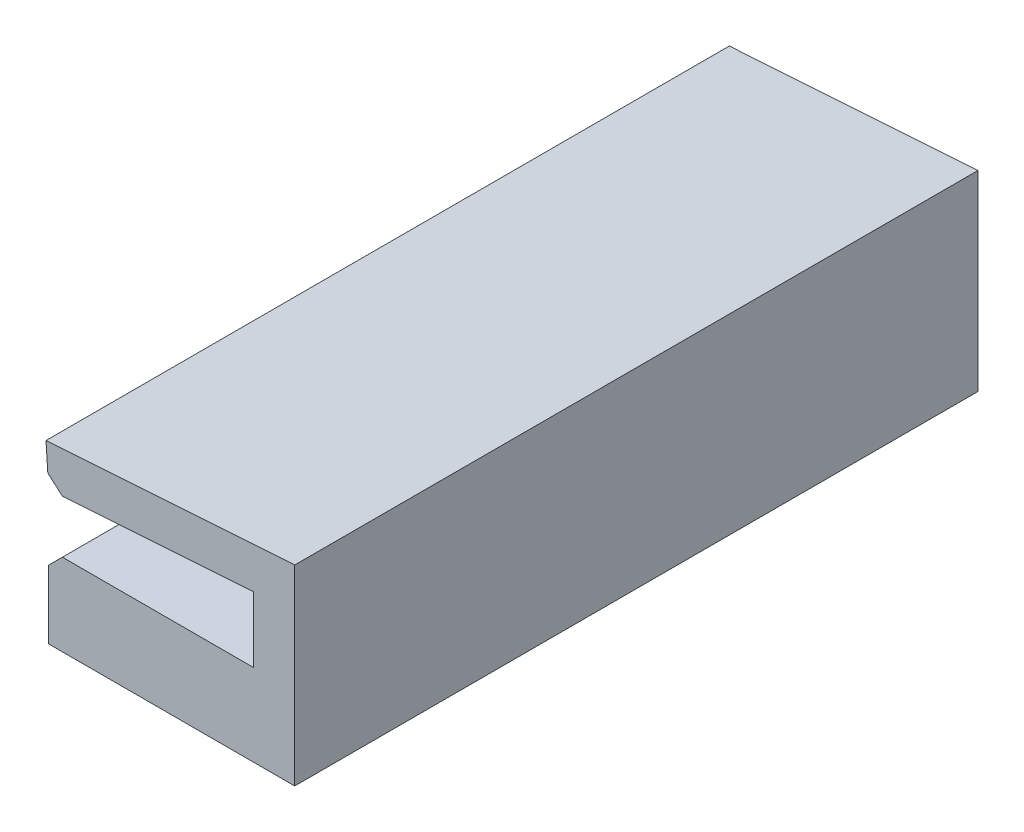
ISO-10303-21;
HEADER;
FILE_DESCRIPTION(('STEP AP214'),'2;1');
FILE_NAME('part.step','',(''),(''),'','','');
FILE_SCHEMA(('AUTOMOTIVE_DESIGN { 1 0 10303 214 1 1 1 1 }'));
ENDSEC;
DATA;
#1=APPLICATION_CONTEXT('core data for automotive mechanical design processes');
#2=APPLICATION_PROTOCOL_DEFINITION('international standard','automotive_design',2000,#1);
#3=PRODUCT_CONTEXT('',#1,'mechanical');
#4=PRODUCT('Part','Part','',(#3));
#5=PRODUCT_RELATED_PRODUCT_CATEGORY('part','',(#4));
#6=PRODUCT_DEFINITION_FORMATION('','',#4);
#7=PRODUCT_DEFINITION_CONTEXT('part definition',#1,'design');
#8=PRODUCT_DEFINITION('design','',#6,#7);
#9=PRODUCT_DEFINITION_SHAPE('','',#8);
#10=(LENGTH_UNIT() NAMED_UNIT(*) SI_UNIT(.MILLI.,.METRE.));
#11=(NAMED_UNIT(*) PLANE_ANGLE_UNIT() SI_UNIT($,.RADIAN.));
#12=(NAMED_UNIT(*) SI_UNIT($,.STERADIAN.) SOLID_ANGLE_UNIT());
#13=UNCERTAINTY_MEASURE_WITH_UNIT(LENGTH_MEASURE(1.E-05),#10,'distance_accuracy_value','');
#14=(GEOMETRIC_REPRESENTATION_CONTEXT(3) GLOBAL_UNCERTAINTY_ASSIGNED_CONTEXT((#13)) GLOBAL_UNIT_ASSIGNED_CONTEXT((#10,
#11,#12)) REPRESENTATION_CONTEXT('',''));
#15=CARTESIAN_POINT('',(0.,0.,0.));
#16=DIRECTION('',(0.,0.,1.));
#17=DIRECTION('',(1.,0.,0.));
#18=AXIS2_PLACEMENT_3D('',#15,#16,#17);
#19=CARTESIAN_POINT('',(0.,0.,50.));
#20=DIRECTION('',(0.,-1.,0.));
#21=DIRECTION('',(1.,0.,0.));
#22=AXIS2_PLACEMENT_3D('',#19,#20,#21);
#23=PLANE('',#22);
#24=DIRECTION('',(-1.,0.,0.));
#25=VECTOR('',#24,1.);
#26=CARTESIAN_POINT('',(0.,0.,0.));
#27=LINE('',#26,#25);
#28=CARTESIAN_POINT('',(0.,0.,0.));
#29=VERTEX_POINT('',#28);
#30=CARTESIAN_POINT('',(-14.,0.,0.));
#31=VERTEX_POINT('',#30);
#32=EDGE_CURVE('E150',#29,#31,#27,.T.);
#33=ORIENTED_EDGE('',*,*,#32,.T.);
#34=DIRECTION('',(0.,0.,1.));
#35=VECTOR('',#34,1.);
#36=CARTESIAN_POINT('',(-14.,0.,50.));
#37=LINE('',#36,#35);
#38=CARTESIAN_POINT('',(-14.,0.,50.));
#39=VERTEX_POINT('',#38);
#40=EDGE_CURVE('E220',#31,#39,#37,.T.);
#41=ORIENTED_EDGE('',*,*,#40,.T.);
#42=DIRECTION('',(-1.,0.,0.));
#43=VECTOR('',#42,1.);
#44=CARTESIAN_POINT('',(0.,0.,50.));
#45=LINE('',#44,#43);
#46=CARTESIAN_POINT('',(0.,0.,50.));
#47=VERTEX_POINT('',#46);
#48=EDGE_CURVE('E175',#47,#39,#45,.T.);
#49=ORIENTED_EDGE('',*,*,#48,.F.);
#50=DIRECTION('',(0.,0.,-1.));
#51=VECTOR('',#50,1.);
#52=CARTESIAN_POINT('',(0.,0.,50.));
#53=LINE('',#52,#51);
#54=EDGE_CURVE('E192',#47,#29,#53,.T.);
#55=ORIENTED_EDGE('',*,*,#54,.T.);
#56=EDGE_LOOP('',(#33,#41,#49,#55));
#57=FACE_BOUND('',#56,.T.);
#58=ADVANCED_FACE('F37',(#57),#23,.F.);
#59=CARTESIAN_POINT('',(-15.,0.,50.));
#60=DIRECTION('',(1.,0.,0.));
#61=DIRECTION('',(0.,0.,-1.));
#62=AXIS2_PLACEMENT_3D('',#59,#60,#61);
#63=PLANE('',#62);
#64=DIRECTION('',(0.,-1.,0.));
#65=VECTOR('',#64,1.);
#66=CARTESIAN_POINT('',(-15.,0.,50.));
#67=LINE('',#66,#65);
#68=CARTESIAN_POINT('',(-15.,-0.999999999999995,50.));
#69=VERTEX_POINT('',#68);
#70=CARTESIAN_POINT('',(-15.,-6.,50.));
#71=VERTEX_POINT('',#70);
#72=EDGE_CURVE('E178',#69,#71,#67,.T.);
#73=ORIENTED_EDGE('',*,*,#72,.F.);
#74=DIRECTION('',(0.,0.,-1.));
#75=VECTOR('',#74,1.);
#76=CARTESIAN_POINT('',(-15.,-0.999999999999995,50.));
#77=LINE('',#76,#75);
#78=CARTESIAN_POINT('',(-15.,-0.999999999999995,0.));
#79=VERTEX_POINT('',#78);
#80=EDGE_CURVE('E147',#69,#79,#77,.T.);
#81=ORIENTED_EDGE('',*,*,#80,.T.);
#82=DIRECTION('',(0.,-1.,0.));
#83=VECTOR('',#82,1.);
#84=CARTESIAN_POINT('',(-15.,0.,0.));
#85=LINE('',#84,#83);
#86=CARTESIAN_POINT('',(-15.,-6.,0.));
#87=VERTEX_POINT('',#86);
#88=EDGE_CURVE('E140',#79,#87,#85,.T.);
#89=ORIENTED_EDGE('',*,*,#88,.T.);
#90=DIRECTION('',(0.,0.,-1.));
#91=VECTOR('',#90,1.);
#92=CARTESIAN_POINT('',(-15.,-6.,50.));
#93=LINE('',#92,#91);
#94=EDGE_CURVE('E145',#71,#87,#93,.T.);
#95=ORIENTED_EDGE('',*,*,#94,.F.);
#96=EDGE_LOOP('',(#73,#81,#89,#95));
#97=FACE_BOUND('',#96,.T.);
#98=ADVANCED_FACE('F143',(#97),#63,.F.);
#99=CARTESIAN_POINT('',(3.,8.00665927567458,50.));
#100=DIRECTION('',(-1.,0.,0.));
#101=DIRECTION('',(0.,0.,1.));
#102=AXIS2_PLACEMENT_3D('',#99,#100,#101);
#103=PLANE('',#102);
#104=DIRECTION('',(0.,1.,0.));
#105=VECTOR('',#104,1.);
#106=CARTESIAN_POINT('',(3.,8.00665927567458,0.));
#107=LINE('',#106,#105);
#108=CARTESIAN_POINT('',(3.,-6.,0.));
#109=VERTEX_POINT('',#108);
#110=CARTESIAN_POINT('',(3.,8.00665927567458,0.));
#111=VERTEX_POINT('',#110);
#112=EDGE_CURVE('E149',#109,#111,#107,.T.);
#113=ORIENTED_EDGE('',*,*,#112,.T.);
#114=DIRECTION('',(0.,0.,-1.));
#115=VECTOR('',#114,1.);
#116=CARTESIAN_POINT('',(3.,8.00665927567458,50.));
#117=LINE('',#116,#115);
#118=CARTESIAN_POINT('',(3.,8.00665927567458,50.));
#119=VERTEX_POINT('',#118);
#120=EDGE_CURVE('E212',#119,#111,#117,.T.);
#121=ORIENTED_EDGE('',*,*,#120,.F.);
#122=DIRECTION('',(0.,1.,0.));
#123=VECTOR('',#122,1.);
#124=CARTESIAN_POINT('',(3.,8.00665927567458,50.));
#125=LINE('',#124,#123);
#126=CARTESIAN_POINT('',(3.,-6.,50.));
#127=VERTEX_POINT('',#126);
#128=EDGE_CURVE('E181',#127,#119,#125,.T.);
#129=ORIENTED_EDGE('',*,*,#128,.F.);
#130=DIRECTION('',(0.,0.,1.));
#131=VECTOR('',#130,1.);
#132=CARTESIAN_POINT('',(3.,-6.,50.));
#133=LINE('',#132,#131);
#134=EDGE_CURVE('E159',#109,#127,#133,.T.);
#135=ORIENTED_EDGE('',*,*,#134,.F.);
#136=EDGE_LOOP('',(#113,#121,#129,#135));
#137=FACE_BOUND('',#136,.T.);
#138=ADVANCED_FACE('F271',(#137),#103,.F.);
#139=CARTESIAN_POINT('',(3.,8.00665927567458,50.));
#140=DIRECTION('',(0.0665190105237739,-0.997785157856609,0.));
#141=DIRECTION('',(0.997785157856609,0.0665190105237739,0.));
#142=AXIS2_PLACEMENT_3D('',#139,#140,#141);
#143=PLANE('',#142);
#144=DIRECTION('',(-0.997785157856609,-0.0665190105237739,0.));
#145=VECTOR('',#144,1.);
#146=CARTESIAN_POINT('',(3.,8.00665927567458,0.));
#147=LINE('',#146,#145);
#148=CARTESIAN_POINT('',(-15.1995570315713,6.79335547356983,0.));
#149=VERTEX_POINT('',#148);
#150=EDGE_CURVE('E196',#111,#149,#147,.T.);
#151=ORIENTED_EDGE('',*,*,#150,.T.);
#152=DIRECTION('',(0.,0.,-1.));
#153=VECTOR('',#152,1.);
#154=CARTESIAN_POINT('',(-15.1995570315713,6.79335547356983,50.));
#155=LINE('',#154,#153);
#156=CARTESIAN_POINT('',(-15.1995570315713,6.79335547356983,50.));
#157=VERTEX_POINT('',#156);
#158=EDGE_CURVE('E209',#157,#149,#155,.T.);
#159=ORIENTED_EDGE('',*,*,#158,.F.);
#160=DIRECTION('',(-0.997785157856609,-0.0665190105237739,0.));
#161=VECTOR('',#160,1.);
#162=CARTESIAN_POINT('',(3.,8.00665927567458,50.));
#163=LINE('',#162,#161);
#164=EDGE_CURVE('E183',#119,#157,#163,.T.);
#165=ORIENTED_EDGE('',*,*,#164,.F.);
#166=ORIENTED_EDGE('',*,*,#120,.T.);
#167=EDGE_LOOP('',(#151,#159,#165,#166));
#168=FACE_BOUND('',#167,.T.);
#169=ADVANCED_FACE('F315',(#168),#143,.F.);
#170=CARTESIAN_POINT('',(-15.,3.8,50.));
#171=DIRECTION('',(0.997785157856609,0.0665190105237733,0.));
#172=DIRECTION('',(-0.0665190105237733,0.997785157856609,0.));
#173=AXIS2_PLACEMENT_3D('',#170,#171,#172);
#174=PLANE('',#173);
#175=DIRECTION('',(0.0665190105237733,-0.997785157856609,0.));
#176=VECTOR('',#175,1.);
#177=CARTESIAN_POINT('',(-15.,3.8,0.));
#178=LINE('',#177,#176);
#179=CARTESIAN_POINT('',(-15.0665190105238,4.79778515785663,0.));
#180=VERTEX_POINT('',#179);
#181=EDGE_CURVE('E198',#149,#180,#178,.T.);
#182=ORIENTED_EDGE('',*,*,#181,.T.);
#183=DIRECTION('',(0.,0.,1.));
#184=VECTOR('',#183,1.);
#185=CARTESIAN_POINT('',(-15.0665190105238,4.79778515785663,50.));
#186=LINE('',#185,#184);
#187=CARTESIAN_POINT('',(-15.0665190105238,4.79778515785663,50.));
#188=VERTEX_POINT('',#187);
#189=EDGE_CURVE('E229',#180,#188,#186,.T.);
#190=ORIENTED_EDGE('',*,*,#189,.T.);
#191=DIRECTION('',(0.0665190105237733,-0.997785157856609,0.));
#192=VECTOR('',#191,1.);
#193=CARTESIAN_POINT('',(-15.,3.8,50.));
#194=LINE('',#193,#192);
#195=EDGE_CURVE('E185',#157,#188,#194,.T.);
#196=ORIENTED_EDGE('',*,*,#195,.F.);
#197=ORIENTED_EDGE('',*,*,#158,.T.);
#198=EDGE_LOOP('',(#182,#190,#196,#197));
#199=FACE_BOUND('',#198,.T.);
#200=ADVANCED_FACE('F311',(#199),#174,.F.);
#201=CARTESIAN_POINT('',(0.,4.8,50.));
#202=DIRECTION('',(-0.066519010523774,0.997785157856609,0.));
#203=DIRECTION('',(-0.997785157856609,-0.066519010523774,0.));
#204=AXIS2_PLACEMENT_3D('',#201,#202,#203);
#205=PLANE('',#204);
#206=DIRECTION('',(0.997785157856609,0.066519010523774,0.));
#207=VECTOR('',#206,1.);
#208=CARTESIAN_POINT('',(0.,4.8,50.));
#209=LINE('',#208,#207);
#210=CARTESIAN_POINT('',(-14.0022148421434,3.86651901052377,50.));
#211=VERTEX_POINT('',#210);
#212=CARTESIAN_POINT('',(0.,4.8,50.));
#213=VERTEX_POINT('',#212);
#214=EDGE_CURVE('E188',#211,#213,#209,.T.);
#215=ORIENTED_EDGE('',*,*,#214,.F.);
#216=DIRECTION('',(0.,0.,-1.));
#217=VECTOR('',#216,1.);
#218=CARTESIAN_POINT('',(-14.0022148421434,3.86651901052377,50.));
#219=LINE('',#218,#217);
#220=CARTESIAN_POINT('',(-14.0022148421434,3.86651901052377,0.));
#221=VERTEX_POINT('',#220);
#222=EDGE_CURVE('E226',#211,#221,#219,.T.);
#223=ORIENTED_EDGE('',*,*,#222,.T.);
#224=DIRECTION('',(0.997785157856609,0.066519010523774,0.));
#225=VECTOR('',#224,1.);
#226=CARTESIAN_POINT('',(0.,4.8,0.));
#227=LINE('',#226,#225);
#228=CARTESIAN_POINT('',(0.,4.8,0.));
#229=VERTEX_POINT('',#228);
#230=EDGE_CURVE('E201',#221,#229,#227,.T.);
#231=ORIENTED_EDGE('',*,*,#230,.T.);
#232=DIRECTION('',(0.,0.,-1.));
#233=VECTOR('',#232,1.);
#234=CARTESIAN_POINT('',(0.,4.8,50.));
#235=LINE('',#234,#233);
#236=EDGE_CURVE('E206',#213,#229,#235,.T.);
#237=ORIENTED_EDGE('',*,*,#236,.F.);
#238=EDGE_LOOP('',(#215,#223,#231,#237));
#239=FACE_BOUND('',#238,.T.);
#240=ADVANCED_FACE('F298',(#239),#205,.F.);
#241=CARTESIAN_POINT('',(0.,4.8,50.));
#242=DIRECTION('',(1.,0.,0.));
#243=DIRECTION('',(0.,1.,0.));
#244=AXIS2_PLACEMENT_3D('',#241,#242,#243);
#245=PLANE('',#244);
#246=DIRECTION('',(0.,-1.,0.));
#247=VECTOR('',#246,1.);
#248=CARTESIAN_POINT('',(0.,4.8,0.));
#249=LINE('',#248,#247);
#250=EDGE_CURVE('E179',#229,#29,#249,.T.);
#251=ORIENTED_EDGE('',*,*,#250,.T.);
#252=ORIENTED_EDGE('',*,*,#54,.F.);
#253=DIRECTION('',(0.,-1.,0.));
#254=VECTOR('',#253,1.);
#255=CARTESIAN_POINT('',(0.,4.8,50.));
#256=LINE('',#255,#254);
#257=EDGE_CURVE('E190',#213,#47,#256,.T.);
#258=ORIENTED_EDGE('',*,*,#257,.F.);
#259=ORIENTED_EDGE('',*,*,#236,.T.);
#260=EDGE_LOOP('',(#251,#252,#258,#259));
#261=FACE_BOUND('',#260,.T.);
#262=ADVANCED_FACE('F304',(#261),#245,.F.);
#263=CARTESIAN_POINT('',(0.,0.,50.));
#264=DIRECTION('',(0.,0.,1.));
#265=DIRECTION('',(1.,0.,0.));
#266=AXIS2_PLACEMENT_3D('',#263,#264,#265);
#267=PLANE('',#266);
#268=ORIENTED_EDGE('',*,*,#48,.T.);
#269=DIRECTION('',(0.70710678118655,0.707106781186545,0.));
#270=VECTOR('',#269,1.);
#271=CARTESIAN_POINT('',(-6.99999999999995,7.,50.));
#272=LINE('',#271,#270);
#273=EDGE_CURVE('E224',#39,#69,#272,.F.);
#274=ORIENTED_EDGE('',*,*,#273,.T.);
#275=ORIENTED_EDGE('',*,*,#72,.T.);
#276=DIRECTION('',(-1.,0.,0.));
#277=VECTOR('',#276,1.);
#278=CARTESIAN_POINT('',(-15.,-6.,50.));
#279=LINE('',#278,#277);
#280=EDGE_CURVE('E164',#127,#71,#279,.T.);
#281=ORIENTED_EDGE('',*,*,#280,.F.);
#282=ORIENTED_EDGE('',*,*,#128,.T.);
#283=ORIENTED_EDGE('',*,*,#164,.T.);
#284=ORIENTED_EDGE('',*,*,#195,.T.);
#285=DIRECTION('',(-0.752576694706875,0.658504607868522,0.));
#286=VECTOR('',#285,1.);
#287=CARTESIAN_POINT('',(-4.15560586438674,-4.74926384501337,50.));
#288=LINE('',#287,#286);
#289=EDGE_CURVE('E222',#188,#211,#288,.F.);
#290=ORIENTED_EDGE('',*,*,#289,.T.);
#291=ORIENTED_EDGE('',*,*,#214,.T.);
#292=ORIENTED_EDGE('',*,*,#257,.T.);
#293=EDGE_LOOP('',(#268,#274,#275,#281,#282,#283,#284,#290,#291,#292));
#294=FACE_BOUND('',#293,.T.);
#295=ADVANCED_FACE('F294',(#294),#267,.T.);
#296=CARTESIAN_POINT('',(0.,0.,0.));
#297=DIRECTION('',(0.,0.,1.));
#298=DIRECTION('',(1.,0.,0.));
#299=AXIS2_PLACEMENT_3D('',#296,#297,#298);
#300=PLANE('',#299);
#301=ORIENTED_EDGE('',*,*,#88,.F.);
#302=DIRECTION('',(-0.70710678118655,-0.707106781186545,0.));
#303=VECTOR('',#302,1.);
#304=CARTESIAN_POINT('',(-15.,-0.999999999999995,0.));
#305=LINE('',#304,#303);
#306=EDGE_CURVE('E218',#79,#31,#305,.F.);
#307=ORIENTED_EDGE('',*,*,#306,.T.);
#308=ORIENTED_EDGE('',*,*,#32,.F.);
#309=ORIENTED_EDGE('',*,*,#250,.F.);
#310=ORIENTED_EDGE('',*,*,#230,.F.);
#311=DIRECTION('',(0.752576694706875,-0.658504607868522,0.));
#312=VECTOR('',#311,1.);
#313=CARTESIAN_POINT('',(-14.0022148421434,3.86651901052377,0.));
#314=LINE('',#313,#312);
#315=EDGE_CURVE('E216',#221,#180,#314,.F.);
#316=ORIENTED_EDGE('',*,*,#315,.T.);
#317=ORIENTED_EDGE('',*,*,#181,.F.);
#318=ORIENTED_EDGE('',*,*,#150,.F.);
#319=ORIENTED_EDGE('',*,*,#112,.F.);
#320=DIRECTION('',(1.,0.,0.));
#321=VECTOR('',#320,1.);
#322=CARTESIAN_POINT('',(-15.,-6.,0.));
#323=LINE('',#322,#321);
#324=EDGE_CURVE('E153',#87,#109,#323,.T.);
#325=ORIENTED_EDGE('',*,*,#324,.F.);
#326=EDGE_LOOP('',(#301,#307,#308,#309,#310,#316,#317,#318,#319,#325));
#327=FACE_BOUND('',#326,.T.);
#328=ADVANCED_FACE('F154',(#327),#300,.F.);
#329=CARTESIAN_POINT('',(0.,-6.,0.));
#330=DIRECTION('',(0.,-1.,0.));
#331=DIRECTION('',(0.,0.,-1.));
#332=AXIS2_PLACEMENT_3D('',#329,#330,#331);
#333=PLANE('',#332);
#334=ORIENTED_EDGE('',*,*,#94,.T.);
#335=ORIENTED_EDGE('',*,*,#324,.T.);
#336=ORIENTED_EDGE('',*,*,#134,.T.);
#337=ORIENTED_EDGE('',*,*,#280,.T.);
#338=EDGE_LOOP('',(#334,#335,#336,#337));
#339=FACE_BOUND('',#338,.T.);
#340=CARTESIAN_POINT('',(-6.,-6.,20.9));
#341=DIRECTION('',(0.,-1.,0.));
#342=DIRECTION('',(0.,0.,1.));
#343=AXIS2_PLACEMENT_3D('',#340,#341,#342);
#344=CIRCLE('',#343,4.);
#345=CARTESIAN_POINT('',(-7.64864328808813,-6.,24.5444444444444));
#346=VERTEX_POINT('',#345);
#347=CARTESIAN_POINT('',(-4.35135671191188,-6.,24.5444444444444));
#348=VERTEX_POINT('',#347);
#349=EDGE_CURVE('E165',#346,#348,#344,.T.);
#350=ORIENTED_EDGE('',*,*,#349,.F.);
#351=CARTESIAN_POINT('',(-7.85472369909915,-6.,25.));
#352=DIRECTION('',(0.,-1.,0.));
#353=DIRECTION('',(0.,0.,-1.));
#354=AXIS2_PLACEMENT_3D('',#351,#352,#353);
#355=CIRCLE('',#354,0.5);
#356=CARTESIAN_POINT('',(-7.64864328808813,-6.,25.4555555555556));
#357=VERTEX_POINT('',#356);
#358=EDGE_CURVE('E241',#346,#357,#355,.T.);
#359=ORIENTED_EDGE('',*,*,#358,.T.);
#360=CARTESIAN_POINT('',(-6.,-6.,29.1));
#361=DIRECTION('',(0.,-1.,0.));
#362=DIRECTION('',(0.,0.,-1.));
#363=AXIS2_PLACEMENT_3D('',#360,#361,#362);
#364=CIRCLE('',#363,4.);
#365=CARTESIAN_POINT('',(-4.35135671191188,-6.,25.4555555555556));
#366=VERTEX_POINT('',#365);
#367=EDGE_CURVE('E167',#366,#357,#364,.T.);
#368=ORIENTED_EDGE('',*,*,#367,.F.);
#369=CARTESIAN_POINT('',(-4.14527630090086,-6.,25.));
#370=DIRECTION('',(0.,-1.,0.));
#371=DIRECTION('',(0.,0.,-1.));
#372=AXIS2_PLACEMENT_3D('',#369,#370,#371);
#373=CIRCLE('',#372,0.5);
#374=EDGE_CURVE('E52',#366,#348,#373,.T.);
#375=ORIENTED_EDGE('',*,*,#374,.T.);
#376=EDGE_LOOP('',(#350,#359,#368,#375));
#377=FACE_BOUND('',#376,.T.);
#378=ADVANCED_FACE('F162',(#339,#377),#333,.T.);
#379=CARTESIAN_POINT('',(-6.,-6.,29.1));
#380=DIRECTION('',(0.,1.,0.));
#381=DIRECTION('',(0.,0.,1.));
#382=AXIS2_PLACEMENT_3D('',#379,#380,#381);
#383=CYLINDRICAL_SURFACE('',#382,4.);
#384=ORIENTED_EDGE('',*,*,#367,.T.);
#385=DIRECTION('',(0.,1.,0.));
#386=VECTOR('',#385,1.);
#387=CARTESIAN_POINT('',(-7.64864328808813,-6.,25.4555555555556));
#388=LINE('',#387,#386);
#389=CARTESIAN_POINT('',(-7.64864328808813,-3.,25.4555555555556));
#390=VERTEX_POINT('',#389);
#391=EDGE_CURVE('E233',#357,#390,#388,.T.);
#392=ORIENTED_EDGE('',*,*,#391,.T.);
#393=CARTESIAN_POINT('',(-6.,-3.,29.1));
#394=DIRECTION('',(0.,-1.,0.));
#395=DIRECTION('',(0.,0.,-1.));
#396=AXIS2_PLACEMENT_3D('',#393,#394,#395);
#397=CIRCLE('',#396,4.);
#398=CARTESIAN_POINT('',(-4.35135671191188,-3.,25.4555555555556));
#399=VERTEX_POINT('',#398);
#400=EDGE_CURVE('E247',#399,#390,#397,.T.);
#401=ORIENTED_EDGE('',*,*,#400,.F.);
#402=DIRECTION('',(0.,1.,0.));
#403=VECTOR('',#402,1.);
#404=CARTESIAN_POINT('',(-4.35135671191188,-6.,25.4555555555556));
#405=LINE('',#404,#403);
#406=EDGE_CURVE('E231',#399,#366,#405,.F.);
#407=ORIENTED_EDGE('',*,*,#406,.T.);
#408=EDGE_LOOP('',(#384,#392,#401,#407));
#409=FACE_BOUND('',#408,.T.);
#410=ADVANCED_FACE('F256',(#409),#383,.F.);
#411=CARTESIAN_POINT('',(-6.,-6.,20.9));
#412=DIRECTION('',(0.,1.,0.));
#413=DIRECTION('',(0.,0.,1.));
#414=AXIS2_PLACEMENT_3D('',#411,#412,#413);
#415=CYLINDRICAL_SURFACE('',#414,4.);
#416=CARTESIAN_POINT('',(-6.,-3.,20.9));
#417=DIRECTION('',(0.,-1.,0.));
#418=DIRECTION('',(0.,0.,1.));
#419=AXIS2_PLACEMENT_3D('',#416,#417,#418);
#420=CIRCLE('',#419,4.);
#421=CARTESIAN_POINT('',(-7.64864328808813,-3.,24.5444444444444));
#422=VERTEX_POINT('',#421);
#423=CARTESIAN_POINT('',(-4.35135671191188,-3.,24.5444444444444));
#424=VERTEX_POINT('',#423);
#425=EDGE_CURVE('E170',#422,#424,#420,.T.);
#426=ORIENTED_EDGE('',*,*,#425,.F.);
#427=DIRECTION('',(0.,1.,0.));
#428=VECTOR('',#427,1.);
#429=CARTESIAN_POINT('',(-7.64864328808813,-6.,24.5444444444444));
#430=LINE('',#429,#428);
#431=EDGE_CURVE('E59',#422,#346,#430,.F.);
#432=ORIENTED_EDGE('',*,*,#431,.T.);
#433=ORIENTED_EDGE('',*,*,#349,.T.);
#434=DIRECTION('',(0.,1.,0.));
#435=VECTOR('',#434,1.);
#436=CARTESIAN_POINT('',(-4.35135671191188,-6.,24.5444444444444));
#437=LINE('',#436,#435);
#438=EDGE_CURVE('E236',#348,#424,#437,.T.);
#439=ORIENTED_EDGE('',*,*,#438,.T.);
#440=EDGE_LOOP('',(#426,#432,#433,#439));
#441=FACE_BOUND('',#440,.T.);
#442=ADVANCED_FACE('F250',(#441),#415,.F.);
#443=CARTESIAN_POINT('',(3.,-3.,50.));
#444=DIRECTION('',(0.,1.,0.));
#445=DIRECTION('',(0.,0.,1.));
#446=AXIS2_PLACEMENT_3D('',#443,#444,#445);
#447=PLANE('',#446);
#448=ORIENTED_EDGE('',*,*,#400,.T.);
#449=CARTESIAN_POINT('',(-7.85472369909915,-3.,25.));
#450=DIRECTION('',(0.,1.,0.));
#451=DIRECTION('',(0.,0.,1.));
#452=AXIS2_PLACEMENT_3D('',#449,#450,#451);
#453=CIRCLE('',#452,0.5);
#454=EDGE_CURVE('E45',#390,#422,#453,.T.);
#455=ORIENTED_EDGE('',*,*,#454,.T.);
#456=ORIENTED_EDGE('',*,*,#425,.T.);
#457=CARTESIAN_POINT('',(-4.14527630090086,-3.,25.));
#458=DIRECTION('',(0.,1.,0.));
#459=DIRECTION('',(0.,0.,1.));
#460=AXIS2_PLACEMENT_3D('',#457,#458,#459);
#461=CIRCLE('',#460,0.5);
#462=EDGE_CURVE('E11',#424,#399,#461,.T.);
#463=ORIENTED_EDGE('',*,*,#462,.T.);
#464=EDGE_LOOP('',(#448,#455,#456,#463));
#465=FACE_BOUND('',#464,.T.);
#466=ADVANCED_FACE('F245',(#465),#447,.F.);
#467=CARTESIAN_POINT('',(-15.,-0.999999999999995,50.));
#468=DIRECTION('',(0.707106781186545,-0.70710678118655,0.));
#469=DIRECTION('',(0.,0.,-1.));
#470=AXIS2_PLACEMENT_3D('',#467,#468,#469);
#471=PLANE('',#470);
#472=ORIENTED_EDGE('',*,*,#273,.F.);
#473=ORIENTED_EDGE('',*,*,#40,.F.);
#474=ORIENTED_EDGE('',*,*,#306,.F.);
#475=ORIENTED_EDGE('',*,*,#80,.F.);
#476=EDGE_LOOP('',(#472,#473,#474,#475));
#477=FACE_BOUND('',#476,.T.);
#478=ADVANCED_FACE('F276',(#477),#471,.F.);
#479=CARTESIAN_POINT('',(-14.0022148421434,3.86651901052377,50.));
#480=DIRECTION('',(0.658504607868522,0.752576694706875,0.));
#481=DIRECTION('',(0.,0.,-1.));
#482=AXIS2_PLACEMENT_3D('',#479,#480,#481);
#483=PLANE('',#482);
#484=ORIENTED_EDGE('',*,*,#289,.F.);
#485=ORIENTED_EDGE('',*,*,#189,.F.);
#486=ORIENTED_EDGE('',*,*,#315,.F.);
#487=ORIENTED_EDGE('',*,*,#222,.F.);
#488=EDGE_LOOP('',(#484,#485,#486,#487));
#489=FACE_BOUND('',#488,.T.);
#490=ADVANCED_FACE('F264',(#489),#483,.F.);
#491=CARTESIAN_POINT('',(-7.85472369909915,-6.,25.));
#492=DIRECTION('',(0.,1.,0.));
#493=DIRECTION('',(0.,0.,1.));
#494=AXIS2_PLACEMENT_3D('',#491,#492,#493);
#495=CYLINDRICAL_SURFACE('',#494,0.5);
#496=ORIENTED_EDGE('',*,*,#358,.F.);
#497=ORIENTED_EDGE('',*,*,#431,.F.);
#498=ORIENTED_EDGE('',*,*,#454,.F.);
#499=ORIENTED_EDGE('',*,*,#391,.F.);
#500=EDGE_LOOP('',(#496,#497,#498,#499));
#501=FACE_BOUND('',#500,.T.);
#502=ADVANCED_FACE('F253',(#501),#495,.T.);
#503=CARTESIAN_POINT('',(-4.14527630090086,-6.,25.));
#504=DIRECTION('',(0.,1.,0.));
#505=DIRECTION('',(0.,0.,1.));
#506=AXIS2_PLACEMENT_3D('',#503,#504,#505);
#507=CYLINDRICAL_SURFACE('',#506,0.5);
#508=ORIENTED_EDGE('',*,*,#374,.F.);
#509=ORIENTED_EDGE('',*,*,#406,.F.);
#510=ORIENTED_EDGE('',*,*,#462,.F.);
#511=ORIENTED_EDGE('',*,*,#438,.F.);
#512=EDGE_LOOP('',(#508,#509,#510,#511));
#513=FACE_BOUND('',#512,.T.);
#514=ADVANCED_FACE('F39',(#513),#507,.T.);
#515=CLOSED_SHELL('',(#58,#98,#138,#169,#200,#240,#262,#295,#328,#378,#410,#442,#466,#478,#490,
#502,#514));
#516=MANIFOLD_SOLID_BREP('B2',#515);
#517=ADVANCED_BREP_SHAPE_REPRESENTATION('',(#18,#516),#14);
#518=SHAPE_DEFINITION_REPRESENTATION(#9,#517);
ENDSEC;
END-ISO-10303-21;
